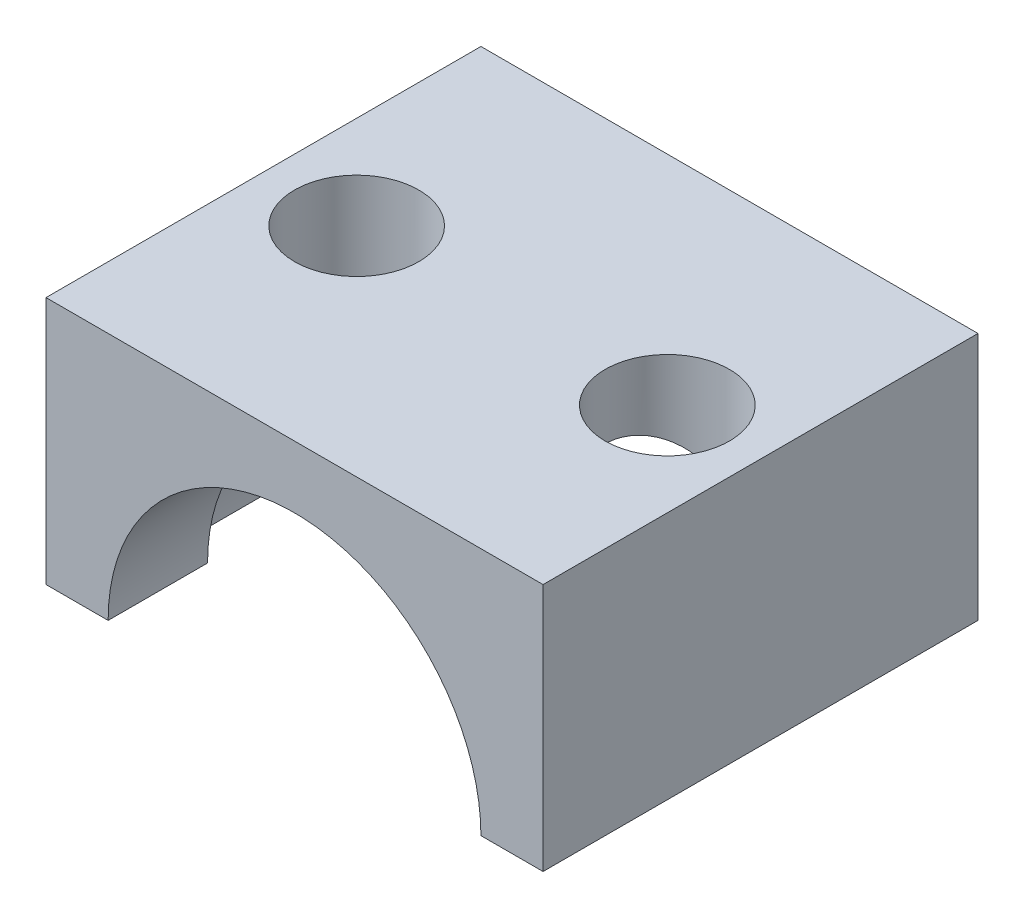
ISO-10303-21;
HEADER;
FILE_DESCRIPTION(('STEP AP214'),'2;1');
FILE_NAME('part.step','',(''),(''),'','','');
FILE_SCHEMA(('AUTOMOTIVE_DESIGN { 1 0 10303 214 1 1 1 1 }'));
ENDSEC;
DATA;
#1=APPLICATION_CONTEXT('core data for automotive mechanical design processes');
#2=APPLICATION_PROTOCOL_DEFINITION('international standard','automotive_design',2000,#1);
#3=PRODUCT_CONTEXT('',#1,'mechanical');
#4=PRODUCT('Part','Part','',(#3));
#5=PRODUCT_RELATED_PRODUCT_CATEGORY('part','',(#4));
#6=PRODUCT_DEFINITION_FORMATION('','',#4);
#7=PRODUCT_DEFINITION_CONTEXT('part definition',#1,'design');
#8=PRODUCT_DEFINITION('design','',#6,#7);
#9=PRODUCT_DEFINITION_SHAPE('','',#8);
#10=(LENGTH_UNIT() NAMED_UNIT(*) SI_UNIT(.MILLI.,.METRE.));
#11=(NAMED_UNIT(*) PLANE_ANGLE_UNIT() SI_UNIT($,.RADIAN.));
#12=(NAMED_UNIT(*) SI_UNIT($,.STERADIAN.) SOLID_ANGLE_UNIT());
#13=UNCERTAINTY_MEASURE_WITH_UNIT(LENGTH_MEASURE(1.E-05),#10,'distance_accuracy_value','');
#14=(GEOMETRIC_REPRESENTATION_CONTEXT(3) GLOBAL_UNCERTAINTY_ASSIGNED_CONTEXT((#13)) GLOBAL_UNIT_ASSIGNED_CONTEXT((#10,
#11,#12)) REPRESENTATION_CONTEXT('',''));
#15=CARTESIAN_POINT('',(0.,0.,0.));
#16=DIRECTION('',(0.,0.,1.));
#17=DIRECTION('',(1.,0.,0.));
#18=AXIS2_PLACEMENT_3D('',#15,#16,#17);
#19=CARTESIAN_POINT('',(0.,0.,14.));
#20=DIRECTION('',(0.,0.,-1.));
#21=DIRECTION('',(-1.,0.,0.));
#22=AXIS2_PLACEMENT_3D('',#19,#20,#21);
#23=CYLINDRICAL_SURFACE('',#22,6.);
#24=CARTESIAN_POINT('',(0.,0.,3.2));
#25=DIRECTION('',(0.,0.,1.));
#26=DIRECTION('',(1.,0.,0.));
#27=AXIS2_PLACEMENT_3D('',#24,#25,#26);
#28=CIRCLE('',#27,6.);
#29=CARTESIAN_POINT('',(-6.,0.,3.2));
#30=VERTEX_POINT('',#29);
#31=CARTESIAN_POINT('',(6.,0.,3.2));
#32=VERTEX_POINT('',#31);
#33=EDGE_CURVE('E214',#30,#32,#28,.F.);
#34=ORIENTED_EDGE('',*,*,#33,.F.);
#35=DIRECTION('',(0.,0.,-1.));
#36=VECTOR('',#35,1.);
#37=CARTESIAN_POINT('',(-6.,0.,14.));
#38=LINE('',#37,#36);
#39=CARTESIAN_POINT('',(-6.,0.,0.));
#40=VERTEX_POINT('',#39);
#41=EDGE_CURVE('E201',#30,#40,#38,.T.);
#42=ORIENTED_EDGE('',*,*,#41,.T.);
#43=CARTESIAN_POINT('',(0.,0.,0.));
#44=DIRECTION('',(0.,0.,-1.));
#45=DIRECTION('',(1.,0.,0.));
#46=AXIS2_PLACEMENT_3D('',#43,#44,#45);
#47=CIRCLE('',#46,6.);
#48=CARTESIAN_POINT('',(6.,0.,0.));
#49=VERTEX_POINT('',#48);
#50=EDGE_CURVE('E220',#40,#49,#47,.T.);
#51=ORIENTED_EDGE('',*,*,#50,.T.);
#52=DIRECTION('',(0.,0.,-1.));
#53=VECTOR('',#52,1.);
#54=CARTESIAN_POINT('',(6.,0.,14.));
#55=LINE('',#54,#53);
#56=EDGE_CURVE('E216',#32,#49,#55,.T.);
#57=ORIENTED_EDGE('',*,*,#56,.F.);
#58=EDGE_LOOP('',(#34,#42,#51,#57));
#59=FACE_BOUND('',#58,.T.);
#60=ADVANCED_FACE('F30',(#59),#23,.F.);
#61=CARTESIAN_POINT('',(8.,8.,14.));
#62=DIRECTION('',(0.,-1.,0.));
#63=DIRECTION('',(0.,0.,-1.));
#64=AXIS2_PLACEMENT_3D('',#61,#62,#63);
#65=PLANE('',#64);
#66=CARTESIAN_POINT('',(5.,8.,7.));
#67=DIRECTION('',(0.,1.,0.));
#68=DIRECTION('',(0.,0.,1.));
#69=AXIS2_PLACEMENT_3D('',#66,#67,#68);
#70=CIRCLE('',#69,2.);
#71=CARTESIAN_POINT('',(5.,8.,9.));
#72=VERTEX_POINT('',#71);
#73=EDGE_CURVE('E133',#72,#72,#70,.T.);
#74=ORIENTED_EDGE('',*,*,#73,.F.);
#75=EDGE_LOOP('',(#74));
#76=FACE_BOUND('',#75,.T.);
#77=CARTESIAN_POINT('',(-5.,8.,7.));
#78=DIRECTION('',(0.,1.,0.));
#79=DIRECTION('',(0.,0.,1.));
#80=AXIS2_PLACEMENT_3D('',#77,#78,#79);
#81=CIRCLE('',#80,2.);
#82=CARTESIAN_POINT('',(-5.,8.,9.));
#83=VERTEX_POINT('',#82);
#84=EDGE_CURVE('E132',#83,#83,#81,.T.);
#85=ORIENTED_EDGE('',*,*,#84,.F.);
#86=EDGE_LOOP('',(#85));
#87=FACE_BOUND('',#86,.T.);
#88=DIRECTION('',(-1.,0.,0.));
#89=VECTOR('',#88,1.);
#90=CARTESIAN_POINT('',(8.,8.,0.));
#91=LINE('',#90,#89);
#92=CARTESIAN_POINT('',(8.,8.,0.));
#93=VERTEX_POINT('',#92);
#94=CARTESIAN_POINT('',(-8.,8.,0.));
#95=VERTEX_POINT('',#94);
#96=EDGE_CURVE('E244',#93,#95,#91,.T.);
#97=ORIENTED_EDGE('',*,*,#96,.T.);
#98=DIRECTION('',(0.,0.,-1.));
#99=VECTOR('',#98,1.);
#100=CARTESIAN_POINT('',(-8.,8.,14.));
#101=LINE('',#100,#99);
#102=CARTESIAN_POINT('',(-8.,8.,14.));
#103=VERTEX_POINT('',#102);
#104=EDGE_CURVE('E204',#103,#95,#101,.T.);
#105=ORIENTED_EDGE('',*,*,#104,.F.);
#106=DIRECTION('',(-1.,0.,0.));
#107=VECTOR('',#106,1.);
#108=CARTESIAN_POINT('',(8.,8.,14.));
#109=LINE('',#108,#107);
#110=CARTESIAN_POINT('',(8.,8.,14.));
#111=VERTEX_POINT('',#110);
#112=EDGE_CURVE('E235',#111,#103,#109,.T.);
#113=ORIENTED_EDGE('',*,*,#112,.F.);
#114=DIRECTION('',(0.,0.,-1.));
#115=VECTOR('',#114,1.);
#116=CARTESIAN_POINT('',(8.,8.,14.));
#117=LINE('',#116,#115);
#118=EDGE_CURVE('E224',#111,#93,#117,.T.);
#119=ORIENTED_EDGE('',*,*,#118,.T.);
#120=EDGE_LOOP('',(#97,#105,#113,#119));
#121=FACE_BOUND('',#120,.T.);
#122=ADVANCED_FACE('F32',(#76,#87,#121),#65,.F.);
#123=CARTESIAN_POINT('',(-8.,0.,14.));
#124=DIRECTION('',(1.,0.,0.));
#125=DIRECTION('',(0.,0.,-1.));
#126=AXIS2_PLACEMENT_3D('',#123,#124,#125);
#127=PLANE('',#126);
#128=DIRECTION('',(0.,-1.,0.));
#129=VECTOR('',#128,1.);
#130=CARTESIAN_POINT('',(-8.,0.,0.));
#131=LINE('',#130,#129);
#132=CARTESIAN_POINT('',(-8.,0.,0.));
#133=VERTEX_POINT('',#132);
#134=EDGE_CURVE('E242',#95,#133,#131,.T.);
#135=ORIENTED_EDGE('',*,*,#134,.T.);
#136=DIRECTION('',(0.,0.,-1.));
#137=VECTOR('',#136,1.);
#138=CARTESIAN_POINT('',(-8.,0.,14.));
#139=LINE('',#138,#137);
#140=CARTESIAN_POINT('',(-8.,0.,14.));
#141=VERTEX_POINT('',#140);
#142=EDGE_CURVE('E200',#141,#133,#139,.T.);
#143=ORIENTED_EDGE('',*,*,#142,.F.);
#144=DIRECTION('',(0.,-1.,0.));
#145=VECTOR('',#144,1.);
#146=CARTESIAN_POINT('',(-8.,0.,14.));
#147=LINE('',#146,#145);
#148=EDGE_CURVE('E253',#103,#141,#147,.T.);
#149=ORIENTED_EDGE('',*,*,#148,.F.);
#150=ORIENTED_EDGE('',*,*,#104,.T.);
#151=EDGE_LOOP('',(#135,#143,#149,#150));
#152=FACE_BOUND('',#151,.T.);
#153=ADVANCED_FACE('F175',(#152),#127,.F.);
#154=CARTESIAN_POINT('',(-6.,0.,14.));
#155=DIRECTION('',(0.,1.,0.));
#156=DIRECTION('',(-1.,0.,0.));
#157=AXIS2_PLACEMENT_3D('',#154,#155,#156);
#158=PLANE('',#157);
#159=DIRECTION('',(0.,0.,-1.));
#160=VECTOR('',#159,1.);
#161=CARTESIAN_POINT('',(-6.9885699723544,0.,10.8));
#162=LINE('',#161,#160);
#163=CARTESIAN_POINT('',(-6.9885699723544,0.,6.78648310359493));
#164=VERTEX_POINT('',#163);
#165=CARTESIAN_POINT('',(-6.9885699723544,0.,3.2));
#166=VERTEX_POINT('',#165);
#167=EDGE_CURVE('E259',#164,#166,#162,.T.);
#168=ORIENTED_EDGE('',*,*,#167,.F.);
#169=CARTESIAN_POINT('',(-5.,0.,7.));
#170=DIRECTION('',(0.,1.,0.));
#171=DIRECTION('',(0.,0.,1.));
#172=AXIS2_PLACEMENT_3D('',#169,#170,#171);
#173=CIRCLE('',#172,2.);
#174=CARTESIAN_POINT('',(-6.98856997235439,0.,7.21351689640507));
#175=VERTEX_POINT('',#174);
#176=EDGE_CURVE('E55',#164,#175,#173,.T.);
#177=ORIENTED_EDGE('',*,*,#176,.T.);
#178=CARTESIAN_POINT('',(-6.9885699723544,0.,10.8));
#179=VERTEX_POINT('',#178);
#180=EDGE_CURVE('E246',#179,#175,#162,.T.);
#181=ORIENTED_EDGE('',*,*,#180,.F.);
#182=DIRECTION('',(1.,0.,0.));
#183=VECTOR('',#182,1.);
#184=CARTESIAN_POINT('',(-6.,0.,10.8));
#185=LINE('',#184,#183);
#186=CARTESIAN_POINT('',(-6.,0.,10.8));
#187=VERTEX_POINT('',#186);
#188=EDGE_CURVE('E260',#179,#187,#185,.T.);
#189=ORIENTED_EDGE('',*,*,#188,.T.);
#190=CARTESIAN_POINT('',(-6.,0.,14.));
#191=VERTEX_POINT('',#190);
#192=EDGE_CURVE('E193',#191,#187,#38,.T.);
#193=ORIENTED_EDGE('',*,*,#192,.F.);
#194=DIRECTION('',(1.,0.,0.));
#195=VECTOR('',#194,1.);
#196=CARTESIAN_POINT('',(-6.,0.,14.));
#197=LINE('',#196,#195);
#198=EDGE_CURVE('E251',#141,#191,#197,.T.);
#199=ORIENTED_EDGE('',*,*,#198,.F.);
#200=ORIENTED_EDGE('',*,*,#142,.T.);
#201=DIRECTION('',(1.,0.,0.));
#202=VECTOR('',#201,1.);
#203=CARTESIAN_POINT('',(-6.,0.,0.));
#204=LINE('',#203,#202);
#205=EDGE_CURVE('E239',#133,#40,#204,.T.);
#206=ORIENTED_EDGE('',*,*,#205,.T.);
#207=ORIENTED_EDGE('',*,*,#41,.F.);
#208=DIRECTION('',(1.,0.,0.));
#209=VECTOR('',#208,1.);
#210=CARTESIAN_POINT('',(-6.,0.,3.2));
#211=LINE('',#210,#209);
#212=EDGE_CURVE('E263',#166,#30,#211,.T.);
#213=ORIENTED_EDGE('',*,*,#212,.F.);
#214=EDGE_LOOP('',(#168,#177,#181,#189,#193,#199,#200,#206,#207,#213));
#215=FACE_BOUND('',#214,.T.);
#216=ADVANCED_FACE('F181',(#215),#158,.F.);
#217=ORIENTED_EDGE('',*,*,#192,.T.);
#218=CARTESIAN_POINT('',(0.,0.,10.8));
#219=DIRECTION('',(0.,0.,1.));
#220=DIRECTION('',(1.,0.,0.));
#221=AXIS2_PLACEMENT_3D('',#218,#219,#220);
#222=CIRCLE('',#221,6.);
#223=CARTESIAN_POINT('',(6.,0.,10.8));
#224=VERTEX_POINT('',#223);
#225=EDGE_CURVE('E195',#187,#224,#222,.F.);
#226=ORIENTED_EDGE('',*,*,#225,.T.);
#227=CARTESIAN_POINT('',(6.,0.,14.));
#228=VERTEX_POINT('',#227);
#229=EDGE_CURVE('E206',#228,#224,#55,.T.);
#230=ORIENTED_EDGE('',*,*,#229,.F.);
#231=CARTESIAN_POINT('',(0.,0.,14.));
#232=DIRECTION('',(0.,0.,-1.));
#233=DIRECTION('',(1.,0.,0.));
#234=AXIS2_PLACEMENT_3D('',#231,#232,#233);
#235=CIRCLE('',#234,6.);
#236=EDGE_CURVE('E197',#191,#228,#235,.T.);
#237=ORIENTED_EDGE('',*,*,#236,.F.);
#238=EDGE_LOOP('',(#217,#226,#230,#237));
#239=FACE_BOUND('',#238,.T.);
#240=ADVANCED_FACE('F171',(#239),#23,.F.);
#241=CARTESIAN_POINT('',(8.,0.,14.));
#242=DIRECTION('',(0.,1.,0.));
#243=DIRECTION('',(-1.,0.,0.));
#244=AXIS2_PLACEMENT_3D('',#241,#242,#243);
#245=PLANE('',#244);
#246=DIRECTION('',(0.,0.,-1.));
#247=VECTOR('',#246,1.);
#248=CARTESIAN_POINT('',(6.98856997235439,0.,10.8));
#249=LINE('',#248,#247);
#250=CARTESIAN_POINT('',(6.98856997235439,0.,7.21351689640506));
#251=VERTEX_POINT('',#250);
#252=CARTESIAN_POINT('',(6.9885699723544,0.,10.8));
#253=VERTEX_POINT('',#252);
#254=EDGE_CURVE('E131',#251,#253,#249,.F.);
#255=ORIENTED_EDGE('',*,*,#254,.F.);
#256=CARTESIAN_POINT('',(5.,0.,7.));
#257=DIRECTION('',(0.,1.,0.));
#258=DIRECTION('',(0.,0.,1.));
#259=AXIS2_PLACEMENT_3D('',#256,#257,#258);
#260=CIRCLE('',#259,2.);
#261=CARTESIAN_POINT('',(6.98856997235439,0.,6.78648310359494));
#262=VERTEX_POINT('',#261);
#263=EDGE_CURVE('E48',#251,#262,#260,.T.);
#264=ORIENTED_EDGE('',*,*,#263,.T.);
#265=CARTESIAN_POINT('',(6.9885699723544,0.,3.2));
#266=VERTEX_POINT('',#265);
#267=EDGE_CURVE('E129',#266,#262,#249,.F.);
#268=ORIENTED_EDGE('',*,*,#267,.F.);
#269=DIRECTION('',(1.,0.,0.));
#270=VECTOR('',#269,1.);
#271=CARTESIAN_POINT('',(8.,0.,3.2));
#272=LINE('',#271,#270);
#273=EDGE_CURVE('E142',#32,#266,#272,.T.);
#274=ORIENTED_EDGE('',*,*,#273,.F.);
#275=ORIENTED_EDGE('',*,*,#56,.T.);
#276=DIRECTION('',(1.,0.,0.));
#277=VECTOR('',#276,1.);
#278=CARTESIAN_POINT('',(8.,0.,0.));
#279=LINE('',#278,#277);
#280=CARTESIAN_POINT('',(8.,0.,0.));
#281=VERTEX_POINT('',#280);
#282=EDGE_CURVE('E236',#49,#281,#279,.T.);
#283=ORIENTED_EDGE('',*,*,#282,.T.);
#284=DIRECTION('',(0.,0.,-1.));
#285=VECTOR('',#284,1.);
#286=CARTESIAN_POINT('',(8.,0.,14.));
#287=LINE('',#286,#285);
#288=CARTESIAN_POINT('',(8.,0.,14.));
#289=VERTEX_POINT('',#288);
#290=EDGE_CURVE('E222',#289,#281,#287,.T.);
#291=ORIENTED_EDGE('',*,*,#290,.F.);
#292=DIRECTION('',(1.,0.,0.));
#293=VECTOR('',#292,1.);
#294=CARTESIAN_POINT('',(8.,0.,14.));
#295=LINE('',#294,#293);
#296=EDGE_CURVE('E248',#228,#289,#295,.T.);
#297=ORIENTED_EDGE('',*,*,#296,.F.);
#298=ORIENTED_EDGE('',*,*,#229,.T.);
#299=DIRECTION('',(1.,0.,0.));
#300=VECTOR('',#299,1.);
#301=CARTESIAN_POINT('',(8.,0.,10.8));
#302=LINE('',#301,#300);
#303=EDGE_CURVE('E139',#224,#253,#302,.T.);
#304=ORIENTED_EDGE('',*,*,#303,.T.);
#305=EDGE_LOOP('',(#255,#264,#268,#274,#275,#283,#291,#297,#298,#304));
#306=FACE_BOUND('',#305,.T.);
#307=ADVANCED_FACE('F127',(#306),#245,.F.);
#308=CARTESIAN_POINT('',(8.,8.,14.));
#309=DIRECTION('',(-1.,0.,0.));
#310=DIRECTION('',(0.,0.,1.));
#311=AXIS2_PLACEMENT_3D('',#308,#309,#310);
#312=PLANE('',#311);
#313=DIRECTION('',(0.,1.,0.));
#314=VECTOR('',#313,1.);
#315=CARTESIAN_POINT('',(8.,8.,0.));
#316=LINE('',#315,#314);
#317=EDGE_CURVE('E233',#281,#93,#316,.T.);
#318=ORIENTED_EDGE('',*,*,#317,.T.);
#319=ORIENTED_EDGE('',*,*,#118,.F.);
#320=DIRECTION('',(0.,1.,0.));
#321=VECTOR('',#320,1.);
#322=CARTESIAN_POINT('',(8.,8.,14.));
#323=LINE('',#322,#321);
#324=EDGE_CURVE('E230',#289,#111,#323,.T.);
#325=ORIENTED_EDGE('',*,*,#324,.F.);
#326=ORIENTED_EDGE('',*,*,#290,.T.);
#327=EDGE_LOOP('',(#318,#319,#325,#326));
#328=FACE_BOUND('',#327,.T.);
#329=ADVANCED_FACE('F187',(#328),#312,.F.);
#330=CARTESIAN_POINT('',(0.,0.,14.));
#331=DIRECTION('',(0.,0.,1.));
#332=DIRECTION('',(1.,0.,0.));
#333=AXIS2_PLACEMENT_3D('',#330,#331,#332);
#334=PLANE('',#333);
#335=ORIENTED_EDGE('',*,*,#112,.T.);
#336=ORIENTED_EDGE('',*,*,#148,.T.);
#337=ORIENTED_EDGE('',*,*,#198,.T.);
#338=ORIENTED_EDGE('',*,*,#236,.T.);
#339=ORIENTED_EDGE('',*,*,#296,.T.);
#340=ORIENTED_EDGE('',*,*,#324,.T.);
#341=EDGE_LOOP('',(#335,#336,#337,#338,#339,#340));
#342=FACE_BOUND('',#341,.T.);
#343=ADVANCED_FACE('F286',(#342),#334,.T.);
#344=CARTESIAN_POINT('',(0.,0.,0.));
#345=DIRECTION('',(0.,0.,1.));
#346=DIRECTION('',(1.,0.,0.));
#347=AXIS2_PLACEMENT_3D('',#344,#345,#346);
#348=PLANE('',#347);
#349=ORIENTED_EDGE('',*,*,#96,.F.);
#350=ORIENTED_EDGE('',*,*,#317,.F.);
#351=ORIENTED_EDGE('',*,*,#282,.F.);
#352=ORIENTED_EDGE('',*,*,#50,.F.);
#353=ORIENTED_EDGE('',*,*,#205,.F.);
#354=ORIENTED_EDGE('',*,*,#134,.F.);
#355=EDGE_LOOP('',(#349,#350,#351,#352,#353,#354));
#356=FACE_BOUND('',#355,.T.);
#357=ADVANCED_FACE('F166',(#356),#348,.F.);
#358=CARTESIAN_POINT('',(0.,-0.399862153130925,10.8));
#359=DIRECTION('',(0.,0.,-1.));
#360=DIRECTION('',(-1.,0.,0.));
#361=AXIS2_PLACEMENT_3D('',#358,#359,#360);
#362=CYLINDRICAL_SURFACE('',#361,7.);
#363=CARTESIAN_POINT('',(6.9885699723544,0.,7.21351689640505));
#364=CARTESIAN_POINT('',(6.98260913120736,0.10412939153972,7.26900453883635));
#365=CARTESIAN_POINT('',(6.97432266845988,0.208199831836068,7.32432891530317));
#366=CARTESIAN_POINT('',(6.95305836732511,0.416174694844384,7.43440568962025));
#367=CARTESIAN_POINT('',(6.94008012854597,0.520079102626939,7.48915803824375));
#368=CARTESIAN_POINT('',(6.89398302263735,0.831895165255373,7.65241059180628));
#369=CARTESIAN_POINT('',(6.85372726778979,1.03945691004163,7.75966313086402));
#370=CARTESIAN_POINT('',(6.75313483457679,1.45525500521469,7.96965688107877));
#371=CARTESIAN_POINT('',(6.69256541513152,1.66347010670329,8.07232941187542));
#372=CARTESIAN_POINT('',(6.55085383568995,2.07683274119668,8.26866003043093));
#373=CARTESIAN_POINT('',(6.46973626917217,2.28198363300012,8.36232871105015));
#374=CARTESIAN_POINT('',(6.27450249533815,2.71356003179651,8.54789555215075));
#375=CARTESIAN_POINT('',(6.15753691415539,2.93945809132244,8.63812455569497));
#376=CARTESIAN_POINT('',(5.96119657452937,3.27173528665829,8.75552658801256));
#377=CARTESIAN_POINT('',(5.89237219702752,3.38125933599831,8.79163452769481));
#378=CARTESIAN_POINT('',(5.74771078646395,3.59773528357848,8.85667025734741));
#379=CARTESIAN_POINT('',(5.67187564361848,3.70468786538549,8.88559997497853));
#380=CARTESIAN_POINT('',(5.47299703003023,3.96885020082581,8.94728852445968));
#381=CARTESIAN_POINT('',(5.34547341004999,4.12412455689504,8.97458582223754));
#382=CARTESIAN_POINT('',(5.14360177223228,4.3491966807459,8.99598213010263));
#383=CARTESIAN_POINT('',(5.07455456323997,4.42290691990769,8.99985657072733));
#384=CARTESIAN_POINT('',(4.93333567395592,4.56726831395393,9.00013564726777));
#385=CARTESIAN_POINT('',(4.86116506021105,4.63792049684307,8.99654281362724));
#386=CARTESIAN_POINT('',(4.68050358888609,4.80728863622298,8.97725680317642));
#387=CARTESIAN_POINT('',(4.57055585361447,4.90398956191869,8.95676382600984));
#388=CARTESIAN_POINT('',(4.34849475707033,5.08751110256859,8.89441112712339));
#389=CARTESIAN_POINT('',(4.23638446623435,5.17434467031863,8.8525798216641));
#390=CARTESIAN_POINT('',(4.03416192534216,5.32188654209605,8.75428149940972));
#391=CARTESIAN_POINT('',(3.94361221984567,5.38451263903453,8.70162062859542));
#392=CARTESIAN_POINT('',(3.76811222146935,5.50033862064287,8.57920167535289));
#393=CARTESIAN_POINT('',(3.68316020066841,5.55354142278347,8.5094489006087));
#394=CARTESIAN_POINT('',(3.52267168194763,5.64989999905107,8.35282727463397));
#395=CARTESIAN_POINT('',(3.44719578372863,5.69299250259215,8.26585660469605));
#396=CARTESIAN_POINT('',(3.31074545150061,5.76820608604411,8.07701662762166));
#397=CARTESIAN_POINT('',(3.24976528575922,5.80033150462968,7.97515323500825));
#398=CARTESIAN_POINT('',(3.1518407427755,5.85062600198729,7.7717666700209));
#399=CARTESIAN_POINT('',(3.11298934114896,5.86994217532816,7.67144059161352));
#400=CARTESIAN_POINT('',(3.05174594230749,5.89998104317376,7.46466880612839));
#401=CARTESIAN_POINT('',(3.0293480332058,5.91070682440822,7.35822531192987));
#402=CARTESIAN_POINT('',(3.00287743906421,5.92334331944303,7.14852852035564));
#403=CARTESIAN_POINT('',(2.99786993096218,5.92570386011227,7.04541891487748));
#404=CARTESIAN_POINT('',(3.00377815814397,5.92290058631981,6.83976820168921));
#405=CARTESIAN_POINT('',(3.01469147639051,5.91773791400286,6.73722701005697));
#406=CARTESIAN_POINT('',(3.05172837198066,5.89992857462022,6.53686075745006));
#407=CARTESIAN_POINT('',(3.07767285339231,5.88737000096285,6.43899460829624));
#408=CARTESIAN_POINT('',(3.14347749683438,5.85472726488432,6.24940510030129));
#409=CARTESIAN_POINT('',(3.18333725952567,5.83464331842421,6.15768156527015));
#410=CARTESIAN_POINT('',(3.27583753811654,5.78654462265319,5.98152325794004));
#411=CARTESIAN_POINT('',(3.32864453060972,5.75842570969756,5.89720460377266));
#412=CARTESIAN_POINT('',(3.44439729119712,5.69443764971341,5.73916663548438));
#413=CARTESIAN_POINT('',(3.50734427609204,5.65856757236732,5.66544859545076));
#414=CARTESIAN_POINT('',(3.64410111739515,5.5773569334595,5.52639193905743));
#415=CARTESIAN_POINT('',(3.71829814524534,5.53163072154503,5.46166142748348));
#416=CARTESIAN_POINT('',(3.87190167344389,5.43252472013083,5.34571220838826));
#417=CARTESIAN_POINT('',(3.95130990799556,5.37914237571925,5.29449802764184));
#418=CARTESIAN_POINT('',(4.12174672699999,5.25904743485629,5.20022026778671));
#419=CARTESIAN_POINT('',(4.21306861069467,5.19150904880293,5.1587496962348));
#420=CARTESIAN_POINT('',(4.39565139371452,5.04914435174364,5.09100497898739));
#421=CARTESIAN_POINT('',(4.48691221472181,4.97431332833407,5.06474073651203));
#422=CARTESIAN_POINT('',(4.64716580413569,4.83583029306908,5.03005877306018));
#423=CARTESIAN_POINT('',(4.7166289639392,4.77335475552805,5.01898196681511));
#424=CARTESIAN_POINT('',(4.85341559925027,4.64524991476008,5.00419287693035));
#425=CARTESIAN_POINT('',(4.92073812375174,4.57961924146759,5.00048382274639));
#426=CARTESIAN_POINT('',(5.11887053763536,4.37847547932562,4.99916338068851));
#427=CARTESIAN_POINT('',(5.24567353040603,4.2388588283026,5.01139128059642));
#428=CARTESIAN_POINT('',(5.45388452010664,3.9903625573064,5.05012225370716));
#429=CARTESIAN_POINT('',(5.53838198745438,3.88321225210228,5.071950234602));
#430=CARTESIAN_POINT('',(5.70005940226107,3.66556241475555,5.12459568746387));
#431=CARTESIAN_POINT('',(5.77723592850077,3.55506134825829,5.15541733519077));
#432=CARTESIAN_POINT('',(5.92421367865431,3.33131070023665,5.22449022723016));
#433=CARTESIAN_POINT('',(5.99400410849301,3.2180573856337,5.26275211939637));
#434=CARTESIAN_POINT('',(6.12617297291355,2.98945082296656,5.34536799716403));
#435=CARTESIAN_POINT('',(6.18854923512049,2.87409697079926,5.38972376012233));
#436=CARTESIAN_POINT('',(6.33479366751687,2.58476909998309,5.5063912834254));
#437=CARTESIAN_POINT('',(6.41421663546579,2.40976724305159,5.58175178254513));
#438=CARTESIAN_POINT('',(6.55742034452989,2.05706653827664,5.74067960611173));
#439=CARTESIAN_POINT('',(6.62119218562058,1.87936621665114,5.82425156236185));
#440=CARTESIAN_POINT('',(6.73357077423035,1.52213623693508,5.99731655115856));
#441=CARTESIAN_POINT('',(6.7821799877797,1.34260688122609,6.08680861799328));
#442=CARTESIAN_POINT('',(6.86466135386414,0.982364222775506,6.26985689597939));
#443=CARTESIAN_POINT('',(6.89854077699503,0.801651548933178,6.36341107693985));
#444=CARTESIAN_POINT('',(6.94045526710135,0.517198267713121,6.51235752393676));
#445=CARTESIAN_POINT('',(6.95334213265122,0.413700686415739,6.56690047962475));
#446=CARTESIAN_POINT('',(6.97443241415853,0.206820166839309,6.67640463446696));
#447=CARTESIAN_POINT('',(6.98264873611334,0.103437708285809,6.73136425162649));
#448=CARTESIAN_POINT('',(6.98856997235498,-7.29255519400714E-12,6.78648310358088));
#449=B_SPLINE_CURVE_WITH_KNOTS('',3,(#363,#364,#365,#366,#367,#368,#369,#370,#371,#372,#373,
#374,#375,#376,#377,#378,#379,#380,#381,#382,#383,#384,#385,#386,#387,#388,#389,#390,#391,#392,
#393,#394,#395,#396,#397,#398,#399,#400,#401,#402,#403,#404,#405,#406,#407,#408,#409,#410,#411,
#412,#413,#414,#415,#416,#417,#418,#419,#420,#421,#422,#423,#424,#425,#426,#427,#428,#429,#430,
#431,#432,#433,#434,#435,#436,#437,#438,#439,#440,#441,#442,#443,#444,#445,#446,#447,#448),
.UNSPECIFIED.,.F.,.F.,(4,2,2,2,2,2,2,2,2,2,2,2,2,2,2,2,2,2,2,2,2,2,2,2,2,2,2,2,2,2,2,2,2,2,2,2,
2,2,2,2,2,2,4),(0.,0.354376437138729,0.708783123577473,1.41913561469535,2.13792193720887,
2.85585199688706,3.66307387757566,4.0656251755573,4.46806825395201,5.07402123296143,
5.37693493679063,5.67974600864509,6.12163973061574,6.56294651287298,6.92757104934854,
7.29208249926432,7.65881760666105,8.02540746185689,8.3516397047487,8.67775467207219,
8.98604245143518,9.29428343262985,9.59892513012576,9.90355808576815,10.2123348520933,
10.5211486993195,10.8454979651373,11.1699557218045,11.5313731742129,11.8930257380789,
12.1748818427029,12.4568614641233,13.0214997096326,13.4355992550283,13.8498913736228,
14.2647808148126,14.67979152183,15.2981542985081,15.9168678970952,16.5354808163667,
17.1537880418852,17.5067979095283,17.8588275117978),.UNSPECIFIED.);
#450=EDGE_CURVE('E11',#251,#262,#449,.T.);
#451=ORIENTED_EDGE('',*,*,#450,.F.);
#452=ORIENTED_EDGE('',*,*,#254,.T.);
#453=CARTESIAN_POINT('',(0.,-0.399862153130925,10.8));
#454=DIRECTION('',(0.,0.,1.));
#455=DIRECTION('',(1.,0.,0.));
#456=AXIS2_PLACEMENT_3D('',#453,#454,#455);
#457=CIRCLE('',#456,7.);
#458=EDGE_CURVE('E266',#253,#179,#457,.T.);
#459=ORIENTED_EDGE('',*,*,#458,.T.);
#460=ORIENTED_EDGE('',*,*,#180,.T.);
#461=CARTESIAN_POINT('',(-6.9885699723544,0.,6.78648310359494));
#462=CARTESIAN_POINT('',(-6.98260913120736,0.104129391539722,6.73099546116364));
#463=CARTESIAN_POINT('',(-6.97432266845988,0.208199831836074,6.67567108469682));
#464=CARTESIAN_POINT('',(-6.95305836732511,0.416174694844394,6.56559431037974));
#465=CARTESIAN_POINT('',(-6.94008012854597,0.520079102626952,6.51084196175624));
#466=CARTESIAN_POINT('',(-6.89398302263734,0.831895165255392,6.34758940819371));
#467=CARTESIAN_POINT('',(-6.85372726778978,1.03945691004165,6.24033686913597));
#468=CARTESIAN_POINT('',(-6.75313483457678,1.45525500521472,6.03034311892122));
#469=CARTESIAN_POINT('',(-6.69256541513151,1.66347010670332,5.92767058812457));
#470=CARTESIAN_POINT('',(-6.55085383568993,2.07683274119672,5.73133996956906));
#471=CARTESIAN_POINT('',(-6.46973626917215,2.28198363300017,5.63767128894983));
#472=CARTESIAN_POINT('',(-6.27450249533813,2.71356003179655,5.45210444784924));
#473=CARTESIAN_POINT('',(-6.15753691415537,2.93945809132248,5.36187544430502));
#474=CARTESIAN_POINT('',(-5.96119657452936,3.27173528665831,5.24447341198743));
#475=CARTESIAN_POINT('',(-5.8923721970275,3.38125933599834,5.20836547230519));
#476=CARTESIAN_POINT('',(-5.74771078646393,3.5977352835785,5.14332974265259));
#477=CARTESIAN_POINT('',(-5.67187564361847,3.70468786538551,5.11440002502146));
#478=CARTESIAN_POINT('',(-5.47299703003022,3.96885020082583,5.05271147554032));
#479=CARTESIAN_POINT('',(-5.34547341004998,4.12412455689505,5.02541417776247));
#480=CARTESIAN_POINT('',(-5.14360177223227,4.34919668074591,5.00401786989737));
#481=CARTESIAN_POINT('',(-5.07455456323996,4.4229069199077,5.00014342927267));
#482=CARTESIAN_POINT('',(-4.93333567395591,4.56726831395394,4.99986435273223));
#483=CARTESIAN_POINT('',(-4.86116506021104,4.63792049684308,5.00345718637277));
#484=CARTESIAN_POINT('',(-4.68050358888608,4.80728863622299,5.02274319682359));
#485=CARTESIAN_POINT('',(-4.57055585361446,4.9039895619187,5.04323617399016));
#486=CARTESIAN_POINT('',(-4.34849475707032,5.0875111025686,5.10558887287661));
#487=CARTESIAN_POINT('',(-4.23638446623434,5.17434467031864,5.14742017833591));
#488=CARTESIAN_POINT('',(-4.03416192534215,5.32188654209606,5.24571850059029));
#489=CARTESIAN_POINT('',(-3.94361221984566,5.38451263903454,5.29837937140459));
#490=CARTESIAN_POINT('',(-3.76811222146934,5.50033862064288,5.42079832464712));
#491=CARTESIAN_POINT('',(-3.6831602006684,5.55354142278348,5.49055109939131));
#492=CARTESIAN_POINT('',(-3.52267168194762,5.64989999905108,5.64717272536604));
#493=CARTESIAN_POINT('',(-3.44719578372863,5.69299250259215,5.73414339530396));
#494=CARTESIAN_POINT('',(-3.3107454515006,5.76820608604412,5.92298337237835));
#495=CARTESIAN_POINT('',(-3.24976528575922,5.80033150462969,6.02484676499176));
#496=CARTESIAN_POINT('',(-3.15184074277549,5.85062600198729,6.22823332997912));
#497=CARTESIAN_POINT('',(-3.11298934114895,5.86994217532817,6.3285594083865));
#498=CARTESIAN_POINT('',(-3.05174594230748,5.89998104317376,6.53533119387163));
#499=CARTESIAN_POINT('',(-3.0293480332058,5.91070682440822,6.64177468807015));
#500=CARTESIAN_POINT('',(-3.00287743906421,5.92334331944303,6.85147147964438));
#501=CARTESIAN_POINT('',(-2.99786993096218,5.92570386011227,6.95458108512254));
#502=CARTESIAN_POINT('',(-3.00377815814397,5.92290058631981,7.16023179831081));
#503=CARTESIAN_POINT('',(-3.01469147639052,5.91773791400286,7.26277298994305));
#504=CARTESIAN_POINT('',(-3.05172837198066,5.89992857462022,7.46313924254995));
#505=CARTESIAN_POINT('',(-3.07767285339232,5.88737000096285,7.56100539170377));
#506=CARTESIAN_POINT('',(-3.14347749683439,5.85472726488431,7.75059489969873));
#507=CARTESIAN_POINT('',(-3.18333725952567,5.8346433184242,7.84231843472986));
#508=CARTESIAN_POINT('',(-3.27583753811655,5.78654462265319,8.01847674205998));
#509=CARTESIAN_POINT('',(-3.32864453060973,5.75842570969755,8.10279539622735));
#510=CARTESIAN_POINT('',(-3.44439729119713,5.6944376497134,8.26083336451563));
#511=CARTESIAN_POINT('',(-3.50734427609205,5.65856757236732,8.33455140454925));
#512=CARTESIAN_POINT('',(-3.64410111739515,5.57735693345949,8.47360806094257));
#513=CARTESIAN_POINT('',(-3.71829814524535,5.53163072154502,8.53833857251653));
#514=CARTESIAN_POINT('',(-3.8719016734439,5.43252472013082,8.65428779161175));
#515=CARTESIAN_POINT('',(-3.95130990799557,5.37914237571925,8.70550197235817));
#516=CARTESIAN_POINT('',(-4.121746727,5.25904743485629,8.7997797322133));
#517=CARTESIAN_POINT('',(-4.21306861069468,5.19150904880292,8.84125030376521));
#518=CARTESIAN_POINT('',(-4.39565139371454,5.04914435174363,8.90899502101262));
#519=CARTESIAN_POINT('',(-4.48691221472182,4.97431332833406,8.93525926348797));
#520=CARTESIAN_POINT('',(-4.64716580413571,4.83583029306907,8.96994122693982));
#521=CARTESIAN_POINT('',(-4.71662896393921,4.77335475552804,8.98101803318489));
#522=CARTESIAN_POINT('',(-4.85341559925028,4.64524991476007,8.99580712306965));
#523=CARTESIAN_POINT('',(-4.92073812375175,4.57961924146758,8.99951617725361));
#524=CARTESIAN_POINT('',(-5.11887053763538,4.37847547932561,9.00083661931149));
#525=CARTESIAN_POINT('',(-5.24567353040604,4.23885882830259,8.98860871940358));
#526=CARTESIAN_POINT('',(-5.45388452010665,3.99036255730638,8.94987774629284));
#527=CARTESIAN_POINT('',(-5.53838198745439,3.88321225210226,8.928049765398));
#528=CARTESIAN_POINT('',(-5.70005940226108,3.66556241475553,8.87540431253612));
#529=CARTESIAN_POINT('',(-5.77723592850078,3.55506134825827,8.84458266480923));
#530=CARTESIAN_POINT('',(-5.92421367865432,3.33131070023663,8.77550977276984));
#531=CARTESIAN_POINT('',(-5.99400410849303,3.21805738563367,8.73724788060363));
#532=CARTESIAN_POINT('',(-6.12617297291356,2.98945082296653,8.65463200283597));
#533=CARTESIAN_POINT('',(-6.1885492351205,2.87409697079924,8.61027623987766));
#534=CARTESIAN_POINT('',(-6.33479366751689,2.58476909998306,8.4936087165746));
#535=CARTESIAN_POINT('',(-6.41421663546581,2.40976724305156,8.41824821745486));
#536=CARTESIAN_POINT('',(-6.5574203445299,2.05706653827661,8.25932039388826));
#537=CARTESIAN_POINT('',(-6.62119218562059,1.87936621665111,8.17574843763813));
#538=CARTESIAN_POINT('',(-6.73357077423036,1.52213623693504,8.00268344884143));
#539=CARTESIAN_POINT('',(-6.78217998777972,1.34260688122605,7.91319138200671));
#540=CARTESIAN_POINT('',(-6.86466135386415,0.982364222775464,7.73014310402059));
#541=CARTESIAN_POINT('',(-6.89854077699504,0.801651548933135,7.63658892306013));
#542=CARTESIAN_POINT('',(-6.94045526710135,0.517198267713085,7.48764247606324));
#543=CARTESIAN_POINT('',(-6.95334213265122,0.41370068641571,7.43309952037524));
#544=CARTESIAN_POINT('',(-6.97443241415853,0.206820166839296,7.32359536553304));
#545=CARTESIAN_POINT('',(-6.98264873611334,0.103437708285803,7.26863574837353));
#546=CARTESIAN_POINT('',(-6.98856997235498,-7.29176056977593E-12,7.21351689641914));
#547=B_SPLINE_CURVE_WITH_KNOTS('',3,(#461,#462,#463,#464,#465,#466,#467,#468,#469,#470,#471,
#472,#473,#474,#475,#476,#477,#478,#479,#480,#481,#482,#483,#484,#485,#486,#487,#488,#489,#490,
#491,#492,#493,#494,#495,#496,#497,#498,#499,#500,#501,#502,#503,#504,#505,#506,#507,#508,#509,
#510,#511,#512,#513,#514,#515,#516,#517,#518,#519,#520,#521,#522,#523,#524,#525,#526,#527,#528,
#529,#530,#531,#532,#533,#534,#535,#536,#537,#538,#539,#540,#541,#542,#543,#544,#545,#546),
.UNSPECIFIED.,.F.,.F.,(4,2,2,2,2,2,2,2,2,2,2,2,2,2,2,2,2,2,2,2,2,2,2,2,2,2,2,2,2,2,2,2,2,2,2,2,
2,2,2,2,2,2,4),(0.,0.354376437138735,0.708783123577484,1.41913561469537,2.13792193720891,
2.85585199688711,3.66307387757568,4.06562517555732,4.46806825395203,5.07402123296145,
5.37693493679064,5.6797460086451,6.12163973061574,6.56294651287299,6.92757104934855,
7.29208249926432,7.65881760666106,8.02540746185689,8.35163970474871,8.67775467207219,
8.98604245143519,9.29428343262986,9.59892513012576,9.90355808576816,10.2123348520933,
10.5211486993195,10.8454979651373,11.1699557218045,11.5313731742129,11.8930257380789,
12.1748818427029,12.4568614641233,13.0214997096326,13.4355992550283,13.8498913736228,
14.2647808148126,14.67979152183,15.2981542985081,15.9168678970952,16.5354808163667,
17.1537880418853,17.5067979095283,17.8588275117978),.UNSPECIFIED.);
#548=EDGE_CURVE('E43',#164,#175,#547,.T.);
#549=ORIENTED_EDGE('',*,*,#548,.F.);
#550=ORIENTED_EDGE('',*,*,#167,.T.);
#551=CARTESIAN_POINT('',(0.,-0.399862153130925,3.2));
#552=DIRECTION('',(0.,0.,1.));
#553=DIRECTION('',(1.,0.,0.));
#554=AXIS2_PLACEMENT_3D('',#551,#552,#553);
#555=CIRCLE('',#554,7.);
#556=EDGE_CURVE('E138',#266,#166,#555,.T.);
#557=ORIENTED_EDGE('',*,*,#556,.F.);
#558=ORIENTED_EDGE('',*,*,#267,.T.);
#559=EDGE_LOOP('',(#451,#452,#459,#460,#549,#550,#557,#558));
#560=FACE_BOUND('',#559,.T.);
#561=ADVANCED_FACE('F136',(#560),#362,.F.);
#562=CARTESIAN_POINT('',(0.,-0.399862153130925,10.8));
#563=DIRECTION('',(0.,0.,1.));
#564=DIRECTION('',(1.,0.,0.));
#565=AXIS2_PLACEMENT_3D('',#562,#563,#564);
#566=PLANE('',#565);
#567=ORIENTED_EDGE('',*,*,#458,.F.);
#568=ORIENTED_EDGE('',*,*,#303,.F.);
#569=ORIENTED_EDGE('',*,*,#225,.F.);
#570=ORIENTED_EDGE('',*,*,#188,.F.);
#571=EDGE_LOOP('',(#567,#568,#569,#570));
#572=FACE_BOUND('',#571,.T.);
#573=ADVANCED_FACE('F159',(#572),#566,.F.);
#574=CARTESIAN_POINT('',(0.,-0.399862153130925,3.2));
#575=DIRECTION('',(0.,0.,1.));
#576=DIRECTION('',(1.,0.,0.));
#577=AXIS2_PLACEMENT_3D('',#574,#575,#576);
#578=PLANE('',#577);
#579=ORIENTED_EDGE('',*,*,#212,.T.);
#580=ORIENTED_EDGE('',*,*,#33,.T.);
#581=ORIENTED_EDGE('',*,*,#273,.T.);
#582=ORIENTED_EDGE('',*,*,#556,.T.);
#583=EDGE_LOOP('',(#579,#580,#581,#582));
#584=FACE_BOUND('',#583,.T.);
#585=ADVANCED_FACE('F156',(#584),#578,.T.);
#586=CARTESIAN_POINT('',(-5.,0.,7.));
#587=DIRECTION('',(0.,1.,0.));
#588=DIRECTION('',(0.,0.,1.));
#589=AXIS2_PLACEMENT_3D('',#586,#587,#588);
#590=CYLINDRICAL_SURFACE('',#589,2.);
#591=ORIENTED_EDGE('',*,*,#548,.T.);
#592=ORIENTED_EDGE('',*,*,#176,.F.);
#593=EDGE_LOOP('',(#591,#592));
#594=FACE_BOUND('',#593,.T.);
#595=ORIENTED_EDGE('',*,*,#84,.T.);
#596=EDGE_LOOP('',(#595));
#597=FACE_BOUND('',#596,.T.);
#598=ADVANCED_FACE('F152',(#594,#597),#590,.F.);
#599=CARTESIAN_POINT('',(5.,0.,7.));
#600=DIRECTION('',(0.,1.,0.));
#601=DIRECTION('',(0.,0.,1.));
#602=AXIS2_PLACEMENT_3D('',#599,#600,#601);
#603=CYLINDRICAL_SURFACE('',#602,2.);
#604=ORIENTED_EDGE('',*,*,#450,.T.);
#605=ORIENTED_EDGE('',*,*,#263,.F.);
#606=EDGE_LOOP('',(#604,#605));
#607=FACE_BOUND('',#606,.T.);
#608=ORIENTED_EDGE('',*,*,#73,.T.);
#609=EDGE_LOOP('',(#608));
#610=FACE_BOUND('',#609,.T.);
#611=ADVANCED_FACE('F120',(#607,#610),#603,.F.);
#612=CLOSED_SHELL('',(#60,#122,#153,#216,#240,#307,#329,#343,#357,#561,#573,#585,#598,#611));
#613=MANIFOLD_SOLID_BREP('B2',#612);
#614=ADVANCED_BREP_SHAPE_REPRESENTATION('',(#18,#613),#14);
#615=SHAPE_DEFINITION_REPRESENTATION(#9,#614);
ENDSEC;
END-ISO-10303-21;
